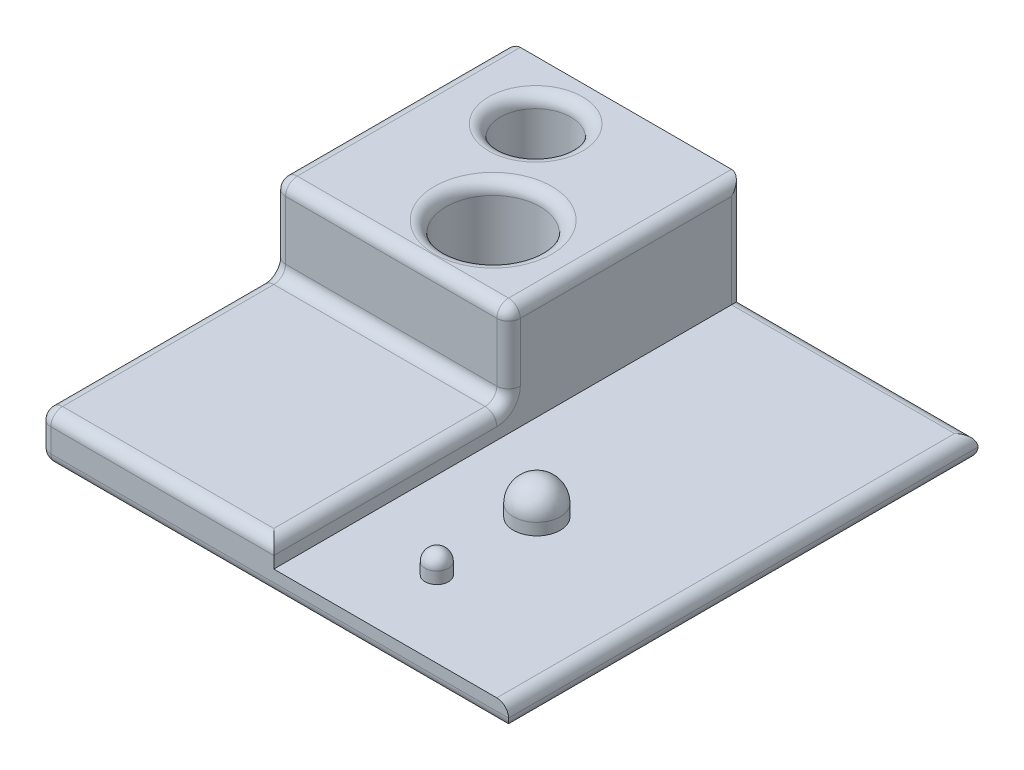
ISO-10303-21;
HEADER;
FILE_DESCRIPTION(('STEP AP214'),'2;1');
FILE_NAME('part.step','',(''),(''),'','','');
FILE_SCHEMA(('AUTOMOTIVE_DESIGN { 1 0 10303 214 1 1 1 1 }'));
ENDSEC;
DATA;
#1=APPLICATION_CONTEXT('core data for automotive mechanical design processes');
#2=APPLICATION_PROTOCOL_DEFINITION('international standard','automotive_design',2000,#1);
#3=PRODUCT_CONTEXT('',#1,'mechanical');
#4=PRODUCT('Part','Part','',(#3));
#5=PRODUCT_RELATED_PRODUCT_CATEGORY('part','',(#4));
#6=PRODUCT_DEFINITION_FORMATION('','',#4);
#7=PRODUCT_DEFINITION_CONTEXT('part definition',#1,'design');
#8=PRODUCT_DEFINITION('design','',#6,#7);
#9=PRODUCT_DEFINITION_SHAPE('','',#8);
#10=(LENGTH_UNIT() NAMED_UNIT(*) SI_UNIT(.MILLI.,.METRE.));
#11=(NAMED_UNIT(*) PLANE_ANGLE_UNIT() SI_UNIT($,.RADIAN.));
#12=(NAMED_UNIT(*) SI_UNIT($,.STERADIAN.) SOLID_ANGLE_UNIT());
#13=UNCERTAINTY_MEASURE_WITH_UNIT(LENGTH_MEASURE(1.E-05),#10,'distance_accuracy_value','');
#14=(GEOMETRIC_REPRESENTATION_CONTEXT(3) GLOBAL_UNCERTAINTY_ASSIGNED_CONTEXT((#13)) GLOBAL_UNIT_ASSIGNED_CONTEXT((#10,
#11,#12)) REPRESENTATION_CONTEXT('',''));
#15=CARTESIAN_POINT('',(0.,0.,0.));
#16=DIRECTION('',(0.,0.,1.));
#17=DIRECTION('',(1.,0.,0.));
#18=AXIS2_PLACEMENT_3D('',#15,#16,#17);
#19=CARTESIAN_POINT('',(0.,2.,0.));
#20=DIRECTION('',(0.,-1.,0.));
#21=DIRECTION('',(0.,0.,-1.));
#22=AXIS2_PLACEMENT_3D('',#19,#20,#21);
#23=PLANE('',#22);
#24=DIRECTION('',(1.,0.,0.));
#25=VECTOR('',#24,1.);
#26=CARTESIAN_POINT('',(0.,2.,-9.5));
#27=LINE('',#26,#25);
#28=CARTESIAN_POINT('',(9.5,2.,-9.5));
#29=VERTEX_POINT('',#28);
#30=CARTESIAN_POINT('',(0.5,2.,-9.5));
#31=VERTEX_POINT('',#30);
#32=EDGE_CURVE('E280',#29,#31,#27,.F.);
#33=ORIENTED_EDGE('',*,*,#32,.T.);
#34=DIRECTION('',(0.,0.,1.));
#35=VECTOR('',#34,1.);
#36=CARTESIAN_POINT('',(0.5,2.,0.));
#37=LINE('',#36,#35);
#38=CARTESIAN_POINT('',(0.5,2.,-0.5));
#39=VERTEX_POINT('',#38);
#40=EDGE_CURVE('E286',#31,#39,#37,.T.);
#41=ORIENTED_EDGE('',*,*,#40,.T.);
#42=DIRECTION('',(1.,0.,0.));
#43=VECTOR('',#42,1.);
#44=CARTESIAN_POINT('',(0.,2.,-0.5));
#45=LINE('',#44,#43);
#46=CARTESIAN_POINT('',(9.5,2.,-0.5));
#47=VERTEX_POINT('',#46);
#48=EDGE_CURVE('E283',#39,#47,#45,.T.);
#49=ORIENTED_EDGE('',*,*,#48,.T.);
#50=DIRECTION('',(0.,0.,-1.));
#51=VECTOR('',#50,1.);
#52=CARTESIAN_POINT('',(9.5,2.,0.));
#53=LINE('',#52,#51);
#54=EDGE_CURVE('E277',#47,#29,#53,.T.);
#55=ORIENTED_EDGE('',*,*,#54,.T.);
#56=EDGE_LOOP('',(#33,#41,#49,#55));
#57=FACE_BOUND('',#56,.T.);
#58=ADVANCED_FACE('F44',(#57),#23,.F.);
#59=CARTESIAN_POINT('',(10.,2.,0.));
#60=DIRECTION('',(-1.,0.,0.));
#61=DIRECTION('',(0.,0.,1.));
#62=AXIS2_PLACEMENT_3D('',#59,#60,#61);
#63=PLANE('',#62);
#64=CARTESIAN_POINT('',(10.,2.5,-9.5));
#65=DIRECTION('',(-1.,0.,0.));
#66=DIRECTION('',(0.,0.,1.));
#67=AXIS2_PLACEMENT_3D('',#64,#65,#66);
#68=CIRCLE('',#67,1.);
#69=CARTESIAN_POINT('',(10.,1.5,-9.5));
#70=VERTEX_POINT('',#69);
#71=CARTESIAN_POINT('',(10.,2.5,-10.5));
#72=VERTEX_POINT('',#71);
#73=EDGE_CURVE('E361',#70,#72,#68,.F.);
#74=ORIENTED_EDGE('',*,*,#73,.F.);
#75=DIRECTION('',(0.,0.,-1.));
#76=VECTOR('',#75,1.);
#77=CARTESIAN_POINT('',(10.,1.5,0.));
#78=LINE('',#77,#76);
#79=CARTESIAN_POINT('',(10.,1.5,0.));
#80=VERTEX_POINT('',#79);
#81=EDGE_CURVE('E374',#70,#80,#78,.F.);
#82=ORIENTED_EDGE('',*,*,#81,.T.);
#83=DIRECTION('',(0.,-1.,0.));
#84=VECTOR('',#83,1.);
#85=CARTESIAN_POINT('',(10.,2.,0.));
#86=LINE('',#85,#84);
#87=CARTESIAN_POINT('',(10.,1.,0.));
#88=VERTEX_POINT('',#87);
#89=EDGE_CURVE('E173',#80,#88,#86,.T.);
#90=ORIENTED_EDGE('',*,*,#89,.T.);
#91=DIRECTION('',(0.,0.,1.));
#92=VECTOR('',#91,1.);
#93=CARTESIAN_POINT('',(10.,1.,0.));
#94=LINE('',#93,#92);
#95=CARTESIAN_POINT('',(10.,1.,-19.5));
#96=VERTEX_POINT('',#95);
#97=EDGE_CURVE('E252',#96,#88,#94,.T.);
#98=ORIENTED_EDGE('',*,*,#97,.F.);
#99=DIRECTION('',(0.,-1.,0.));
#100=VECTOR('',#99,1.);
#101=CARTESIAN_POINT('',(10.,2.,-19.5));
#102=LINE('',#101,#100);
#103=CARTESIAN_POINT('',(10.,5.,-19.5));
#104=VERTEX_POINT('',#103);
#105=EDGE_CURVE('E371',#96,#104,#102,.F.);
#106=ORIENTED_EDGE('',*,*,#105,.T.);
#107=DIRECTION('',(0.,0.,-1.));
#108=VECTOR('',#107,1.);
#109=CARTESIAN_POINT('',(10.,5.,-10.));
#110=LINE('',#109,#108);
#111=CARTESIAN_POINT('',(10.,5.,-10.5));
#112=VERTEX_POINT('',#111);
#113=EDGE_CURVE('E368',#104,#112,#110,.F.);
#114=ORIENTED_EDGE('',*,*,#113,.T.);
#115=DIRECTION('',(0.,-1.,0.));
#116=VECTOR('',#115,1.);
#117=CARTESIAN_POINT('',(10.,2.,-10.5));
#118=LINE('',#117,#116);
#119=EDGE_CURVE('E365',#112,#72,#118,.T.);
#120=ORIENTED_EDGE('',*,*,#119,.T.);
#121=EDGE_LOOP('',(#74,#82,#90,#98,#106,#114,#120));
#122=FACE_BOUND('',#121,.T.);
#123=ADVANCED_FACE('F494',(#122),#63,.F.);
#124=CARTESIAN_POINT('',(0.,2.,0.));
#125=DIRECTION('',(1.,0.,0.));
#126=DIRECTION('',(0.,0.,-1.));
#127=AXIS2_PLACEMENT_3D('',#124,#125,#126);
#128=PLANE('',#127);
#129=DIRECTION('',(0.,0.,1.));
#130=VECTOR('',#129,1.);
#131=CARTESIAN_POINT('',(0.,0.5,0.));
#132=LINE('',#131,#130);
#133=CARTESIAN_POINT('',(0.,0.5,-19.5));
#134=VERTEX_POINT('',#133);
#135=CARTESIAN_POINT('',(0.,0.5,-0.5));
#136=VERTEX_POINT('',#135);
#137=EDGE_CURVE('E299',#134,#136,#132,.T.);
#138=ORIENTED_EDGE('',*,*,#137,.T.);
#139=DIRECTION('',(0.,-1.,0.));
#140=VECTOR('',#139,1.);
#141=CARTESIAN_POINT('',(0.,2.,-0.5));
#142=LINE('',#141,#140);
#143=CARTESIAN_POINT('',(0.,1.5,-0.5));
#144=VERTEX_POINT('',#143);
#145=EDGE_CURVE('E310',#136,#144,#142,.F.);
#146=ORIENTED_EDGE('',*,*,#145,.T.);
#147=DIRECTION('',(0.,0.,1.));
#148=VECTOR('',#147,1.);
#149=CARTESIAN_POINT('',(0.,1.5,0.));
#150=LINE('',#149,#148);
#151=CARTESIAN_POINT('',(0.,1.5,-9.5));
#152=VERTEX_POINT('',#151);
#153=EDGE_CURVE('E306',#144,#152,#150,.F.);
#154=ORIENTED_EDGE('',*,*,#153,.T.);
#155=CARTESIAN_POINT('',(0.,2.5,-9.5));
#156=DIRECTION('',(1.,0.,0.));
#157=DIRECTION('',(0.,0.,-1.));
#158=AXIS2_PLACEMENT_3D('',#155,#156,#157);
#159=CIRCLE('',#158,1.);
#160=CARTESIAN_POINT('',(0.,2.5,-10.5));
#161=VERTEX_POINT('',#160);
#162=EDGE_CURVE('E302',#161,#152,#159,.F.);
#163=ORIENTED_EDGE('',*,*,#162,.F.);
#164=DIRECTION('',(0.,-1.,0.));
#165=VECTOR('',#164,1.);
#166=CARTESIAN_POINT('',(0.,2.,-10.5));
#167=LINE('',#166,#165);
#168=CARTESIAN_POINT('',(0.,5.,-10.5));
#169=VERTEX_POINT('',#168);
#170=EDGE_CURVE('E293',#161,#169,#167,.F.);
#171=ORIENTED_EDGE('',*,*,#170,.T.);
#172=DIRECTION('',(0.,0.,1.));
#173=VECTOR('',#172,1.);
#174=CARTESIAN_POINT('',(0.,5.,-20.));
#175=LINE('',#174,#173);
#176=CARTESIAN_POINT('',(0.,5.,-19.5));
#177=VERTEX_POINT('',#176);
#178=EDGE_CURVE('E290',#169,#177,#175,.F.);
#179=ORIENTED_EDGE('',*,*,#178,.T.);
#180=DIRECTION('',(0.,-1.,0.));
#181=VECTOR('',#180,1.);
#182=CARTESIAN_POINT('',(0.,2.,-19.5));
#183=LINE('',#182,#181);
#184=EDGE_CURVE('E296',#177,#134,#183,.T.);
#185=ORIENTED_EDGE('',*,*,#184,.T.);
#186=EDGE_LOOP('',(#138,#146,#154,#163,#171,#179,#185));
#187=FACE_BOUND('',#186,.T.);
#188=ADVANCED_FACE('F518',(#187),#128,.F.);
#189=CARTESIAN_POINT('',(0.,2.,0.));
#190=DIRECTION('',(0.,0.,-1.));
#191=DIRECTION('',(-1.,0.,0.));
#192=AXIS2_PLACEMENT_3D('',#189,#190,#191);
#193=PLANE('',#192);
#194=DIRECTION('',(1.,0.,0.));
#195=VECTOR('',#194,1.);
#196=CARTESIAN_POINT('',(20.,0.5,0.));
#197=LINE('',#196,#195);
#198=CARTESIAN_POINT('',(0.5,0.5,0.));
#199=VERTEX_POINT('',#198);
#200=CARTESIAN_POINT('',(20.,0.5,0.));
#201=VERTEX_POINT('',#200);
#202=EDGE_CURVE('E335',#199,#201,#197,.T.);
#203=ORIENTED_EDGE('',*,*,#202,.T.);
#204=CARTESIAN_POINT('',(19.5,0.5,0.));
#205=DIRECTION('',(0.,0.,-1.));
#206=DIRECTION('',(-1.,0.,0.));
#207=AXIS2_PLACEMENT_3D('',#204,#205,#206);
#208=CIRCLE('',#207,0.5);
#209=CARTESIAN_POINT('',(19.5,1.,0.));
#210=VERTEX_POINT('',#209);
#211=EDGE_CURVE('E210',#201,#210,#208,.F.);
#212=ORIENTED_EDGE('',*,*,#211,.T.);
#213=DIRECTION('',(1.,0.,0.));
#214=VECTOR('',#213,1.);
#215=CARTESIAN_POINT('',(10.,1.,0.));
#216=LINE('',#215,#214);
#217=EDGE_CURVE('E255',#88,#210,#216,.T.);
#218=ORIENTED_EDGE('',*,*,#217,.F.);
#219=ORIENTED_EDGE('',*,*,#89,.F.);
#220=DIRECTION('',(1.,0.,0.));
#221=VECTOR('',#220,1.);
#222=CARTESIAN_POINT('',(0.,1.5,0.));
#223=LINE('',#222,#221);
#224=CARTESIAN_POINT('',(0.5,1.5,0.));
#225=VERTEX_POINT('',#224);
#226=EDGE_CURVE('E329',#80,#225,#223,.F.);
#227=ORIENTED_EDGE('',*,*,#226,.T.);
#228=DIRECTION('',(0.,-1.,0.));
#229=VECTOR('',#228,1.);
#230=CARTESIAN_POINT('',(0.5,2.,0.));
#231=LINE('',#230,#229);
#232=EDGE_CURVE('E332',#225,#199,#231,.T.);
#233=ORIENTED_EDGE('',*,*,#232,.T.);
#234=EDGE_LOOP('',(#203,#212,#218,#219,#227,#233));
#235=FACE_BOUND('',#234,.T.);
#236=ADVANCED_FACE('F500',(#235),#193,.F.);
#237=CARTESIAN_POINT('',(0.,2.,-20.));
#238=DIRECTION('',(0.,0.,1.));
#239=DIRECTION('',(1.,0.,0.));
#240=AXIS2_PLACEMENT_3D('',#237,#238,#239);
#241=PLANE('',#240);
#242=DIRECTION('',(-1.,0.,0.));
#243=VECTOR('',#242,1.);
#244=CARTESIAN_POINT('',(0.,0.5,-20.));
#245=LINE('',#244,#243);
#246=CARTESIAN_POINT('',(9.5,0.5,-20.));
#247=VERTEX_POINT('',#246);
#248=CARTESIAN_POINT('',(0.5,0.5,-20.));
#249=VERTEX_POINT('',#248);
#250=EDGE_CURVE('E202',#247,#249,#245,.T.);
#251=ORIENTED_EDGE('',*,*,#250,.T.);
#252=DIRECTION('',(0.,-1.,0.));
#253=VECTOR('',#252,1.);
#254=CARTESIAN_POINT('',(0.5,2.,-20.));
#255=LINE('',#254,#253);
#256=CARTESIAN_POINT('',(0.5,5.5,-20.));
#257=VERTEX_POINT('',#256);
#258=EDGE_CURVE('E345',#249,#257,#255,.F.);
#259=ORIENTED_EDGE('',*,*,#258,.T.);
#260=DIRECTION('',(-1.,0.,0.));
#261=VECTOR('',#260,1.);
#262=CARTESIAN_POINT('',(0.,5.5,-20.));
#263=LINE('',#262,#261);
#264=CARTESIAN_POINT('',(9.5,5.5,-20.));
#265=VERTEX_POINT('',#264);
#266=EDGE_CURVE('E246',#265,#257,#263,.T.);
#267=ORIENTED_EDGE('',*,*,#266,.F.);
#268=DIRECTION('',(0.,-1.,0.));
#269=VECTOR('',#268,1.);
#270=CARTESIAN_POINT('',(9.5,2.,-20.));
#271=LINE('',#270,#269);
#272=EDGE_CURVE('E340',#265,#247,#271,.T.);
#273=ORIENTED_EDGE('',*,*,#272,.T.);
#274=EDGE_LOOP('',(#251,#259,#267,#273));
#275=FACE_BOUND('',#274,.T.);
#276=ADVANCED_FACE('F489',(#275),#241,.F.);
#277=CARTESIAN_POINT('',(0.,0.,0.));
#278=DIRECTION('',(0.,-1.,0.));
#279=DIRECTION('',(0.,0.,-1.));
#280=AXIS2_PLACEMENT_3D('',#277,#278,#279);
#281=PLANE('',#280);
#282=DIRECTION('',(-1.,0.,0.));
#283=VECTOR('',#282,1.);
#284=CARTESIAN_POINT('',(20.,0.,-19.5));
#285=LINE('',#284,#283);
#286=CARTESIAN_POINT('',(0.5,0.,-19.5));
#287=VERTEX_POINT('',#286);
#288=CARTESIAN_POINT('',(19.5,0.,-19.5));
#289=VERTEX_POINT('',#288);
#290=EDGE_CURVE('E319',#287,#289,#285,.F.);
#291=ORIENTED_EDGE('',*,*,#290,.T.);
#292=DIRECTION('',(0.,0.,-1.));
#293=VECTOR('',#292,1.);
#294=CARTESIAN_POINT('',(19.5,0.,0.));
#295=LINE('',#294,#293);
#296=CARTESIAN_POINT('',(19.5,0.,-0.5));
#297=VERTEX_POINT('',#296);
#298=EDGE_CURVE('E218',#289,#297,#295,.F.);
#299=ORIENTED_EDGE('',*,*,#298,.T.);
#300=DIRECTION('',(1.,0.,0.));
#301=VECTOR('',#300,1.);
#302=CARTESIAN_POINT('',(0.,0.,-0.5));
#303=LINE('',#302,#301);
#304=CARTESIAN_POINT('',(0.5,0.,-0.5));
#305=VERTEX_POINT('',#304);
#306=EDGE_CURVE('E313',#297,#305,#303,.F.);
#307=ORIENTED_EDGE('',*,*,#306,.T.);
#308=DIRECTION('',(0.,0.,1.));
#309=VECTOR('',#308,1.);
#310=CARTESIAN_POINT('',(0.5,0.,-20.));
#311=LINE('',#310,#309);
#312=EDGE_CURVE('E316',#305,#287,#311,.F.);
#313=ORIENTED_EDGE('',*,*,#312,.T.);
#314=EDGE_LOOP('',(#291,#299,#307,#313));
#315=FACE_BOUND('',#314,.T.);
#316=ADVANCED_FACE('F523',(#315),#281,.T.);
#317=CARTESIAN_POINT('',(0.,1.,0.));
#318=DIRECTION('',(0.,-1.,0.));
#319=DIRECTION('',(0.,0.,-1.));
#320=AXIS2_PLACEMENT_3D('',#317,#318,#319);
#321=PLANE('',#320);
#322=CARTESIAN_POINT('',(13.6729590686425,1.,-7.53387033962573));
#323=DIRECTION('',(0.,-1.,0.));
#324=DIRECTION('',(0.,0.,-1.));
#325=AXIS2_PLACEMENT_3D('',#322,#323,#324);
#326=CIRCLE('',#325,1.);
#327=CARTESIAN_POINT('',(13.6729590686425,1.,-8.53387033962573));
#328=VERTEX_POINT('',#327);
#329=EDGE_CURVE('E269',#328,#328,#326,.F.);
#330=ORIENTED_EDGE('',*,*,#329,.F.);
#331=EDGE_LOOP('',(#330));
#332=FACE_BOUND('',#331,.T.);
#333=CARTESIAN_POINT('',(13.6915029025337,1.,-3.25274872455439));
#334=DIRECTION('',(0.,-1.,0.));
#335=DIRECTION('',(0.,0.,-1.));
#336=AXIS2_PLACEMENT_3D('',#333,#334,#335);
#337=CIRCLE('',#336,0.500000000000001);
#338=CARTESIAN_POINT('',(13.6915029025337,1.,-3.75274872455439));
#339=VERTEX_POINT('',#338);
#340=EDGE_CURVE('E261',#339,#339,#337,.F.);
#341=ORIENTED_EDGE('',*,*,#340,.F.);
#342=EDGE_LOOP('',(#341));
#343=FACE_BOUND('',#342,.T.);
#344=ORIENTED_EDGE('',*,*,#217,.T.);
#345=DIRECTION('',(0.,0.,-1.));
#346=VECTOR('',#345,1.);
#347=CARTESIAN_POINT('',(19.5,1.,0.));
#348=LINE('',#347,#346);
#349=CARTESIAN_POINT('',(19.5,1.,-19.5));
#350=VERTEX_POINT('',#349);
#351=EDGE_CURVE('E326',#210,#350,#348,.T.);
#352=ORIENTED_EDGE('',*,*,#351,.T.);
#353=DIRECTION('',(-1.,0.,0.));
#354=VECTOR('',#353,1.);
#355=CARTESIAN_POINT('',(0.,1.,-19.5));
#356=LINE('',#355,#354);
#357=EDGE_CURVE('E185',#350,#96,#356,.T.);
#358=ORIENTED_EDGE('',*,*,#357,.T.);
#359=ORIENTED_EDGE('',*,*,#97,.T.);
#360=EDGE_LOOP('',(#344,#352,#358,#359));
#361=FACE_BOUND('',#360,.T.);
#362=ADVANCED_FACE('F498',(#332,#343,#361),#321,.F.);
#363=CARTESIAN_POINT('',(13.6915029025337,2.,-3.25274872455439));
#364=DIRECTION('',(0.,-1.,0.));
#365=DIRECTION('',(0.,0.,-1.));
#366=AXIS2_PLACEMENT_3D('',#363,#364,#365);
#367=CYLINDRICAL_SURFACE('',#366,0.500000000000001);
#368=CARTESIAN_POINT('',(13.6915029025337,1.5,-3.25274872455439));
#369=DIRECTION('',(0.,-1.,0.));
#370=DIRECTION('',(0.,0.,-1.));
#371=AXIS2_PLACEMENT_3D('',#368,#369,#370);
#372=CIRCLE('',#371,0.500000000000001);
#373=CARTESIAN_POINT('',(13.6915029025337,1.5,-3.75274872455439));
#374=VERTEX_POINT('',#373);
#375=EDGE_CURVE('E265',#374,#374,#372,.T.);
#376=ORIENTED_EDGE('',*,*,#375,.T.);
#377=EDGE_LOOP('',(#376));
#378=FACE_BOUND('',#377,.T.);
#379=ORIENTED_EDGE('',*,*,#340,.T.);
#380=EDGE_LOOP('',(#379));
#381=FACE_BOUND('',#380,.T.);
#382=ADVANCED_FACE('F530',(#378,#381),#367,.T.);
#383=CARTESIAN_POINT('',(13.6915029025337,1.5,-3.25274872455439));
#384=DIRECTION('',(0.,1.,0.));
#385=DIRECTION('',(0.,0.,1.));
#386=AXIS2_PLACEMENT_3D('',#383,#384,#385);
#387=SPHERICAL_SURFACE('',#386,0.5);
#388=ORIENTED_EDGE('',*,*,#375,.F.);
#389=EDGE_LOOP('',(#388));
#390=FACE_BOUND('',#389,.T.);
#391=ADVANCED_FACE('F545',(#390),#387,.T.);
#392=CARTESIAN_POINT('',(13.6729590686425,2.5,-7.53387033962573));
#393=DIRECTION('',(0.,-1.,0.));
#394=DIRECTION('',(0.,0.,-1.));
#395=AXIS2_PLACEMENT_3D('',#392,#393,#394);
#396=CYLINDRICAL_SURFACE('',#395,1.);
#397=CARTESIAN_POINT('',(13.6729590686425,1.5,-7.53387033962573));
#398=DIRECTION('',(0.,-1.,0.));
#399=DIRECTION('',(0.,0.,-1.));
#400=AXIS2_PLACEMENT_3D('',#397,#398,#399);
#401=CIRCLE('',#400,1.);
#402=CARTESIAN_POINT('',(13.6729590686425,1.5,-8.53387033962573));
#403=VERTEX_POINT('',#402);
#404=EDGE_CURVE('E273',#403,#403,#401,.T.);
#405=ORIENTED_EDGE('',*,*,#404,.T.);
#406=EDGE_LOOP('',(#405));
#407=FACE_BOUND('',#406,.T.);
#408=ORIENTED_EDGE('',*,*,#329,.T.);
#409=EDGE_LOOP('',(#408));
#410=FACE_BOUND('',#409,.T.);
#411=ADVANCED_FACE('F547',(#407,#410),#396,.T.);
#412=CARTESIAN_POINT('',(13.6729590686425,1.5,-7.53387033962573));
#413=DIRECTION('',(0.,1.,0.));
#414=DIRECTION('',(0.,0.,1.));
#415=AXIS2_PLACEMENT_3D('',#412,#413,#414);
#416=SPHERICAL_SURFACE('',#415,1.);
#417=ORIENTED_EDGE('',*,*,#404,.F.);
#418=EDGE_LOOP('',(#417));
#419=FACE_BOUND('',#418,.T.);
#420=ADVANCED_FACE('F550',(#419),#416,.T.);
#421=CARTESIAN_POINT('',(0.,5.5,-10.));
#422=DIRECTION('',(0.,0.,-1.));
#423=DIRECTION('',(-1.,0.,0.));
#424=AXIS2_PLACEMENT_3D('',#421,#422,#423);
#425=PLANE('',#424);
#426=DIRECTION('',(0.,-1.,0.));
#427=VECTOR('',#426,1.);
#428=CARTESIAN_POINT('',(0.5,5.5,-10.));
#429=LINE('',#428,#427);
#430=CARTESIAN_POINT('',(0.5,5.,-10.));
#431=VERTEX_POINT('',#430);
#432=CARTESIAN_POINT('',(0.5,2.5,-10.));
#433=VERTEX_POINT('',#432);
#434=EDGE_CURVE('E351',#431,#433,#429,.T.);
#435=ORIENTED_EDGE('',*,*,#434,.T.);
#436=DIRECTION('',(1.,0.,0.));
#437=VECTOR('',#436,1.);
#438=CARTESIAN_POINT('',(10.,2.5,-10.));
#439=LINE('',#438,#437);
#440=CARTESIAN_POINT('',(9.5,2.5,-10.));
#441=VERTEX_POINT('',#440);
#442=EDGE_CURVE('E357',#433,#441,#439,.T.);
#443=ORIENTED_EDGE('',*,*,#442,.T.);
#444=DIRECTION('',(0.,-1.,0.));
#445=VECTOR('',#444,1.);
#446=CARTESIAN_POINT('',(9.5,5.5,-10.));
#447=LINE('',#446,#445);
#448=CARTESIAN_POINT('',(9.5,5.,-10.));
#449=VERTEX_POINT('',#448);
#450=EDGE_CURVE('E354',#441,#449,#447,.F.);
#451=ORIENTED_EDGE('',*,*,#450,.T.);
#452=DIRECTION('',(1.,0.,0.));
#453=VECTOR('',#452,1.);
#454=CARTESIAN_POINT('',(0.,5.,-10.));
#455=LINE('',#454,#453);
#456=EDGE_CURVE('E348',#449,#431,#455,.F.);
#457=ORIENTED_EDGE('',*,*,#456,.T.);
#458=EDGE_LOOP('',(#435,#443,#451,#457));
#459=FACE_BOUND('',#458,.T.);
#460=ADVANCED_FACE('F552',(#459),#425,.F.);
#461=CARTESIAN_POINT('',(0.,5.5,0.));
#462=DIRECTION('',(0.,1.,0.));
#463=DIRECTION('',(0.,0.,1.));
#464=AXIS2_PLACEMENT_3D('',#461,#462,#463);
#465=PLANE('',#464);
#466=CARTESIAN_POINT('',(6.3008055094386,5.5,-13.0433089425895));
#467=DIRECTION('',(0.,1.,0.));
#468=DIRECTION('',(0.,0.,1.));
#469=AXIS2_PLACEMENT_3D('',#466,#467,#468);
#470=CIRCLE('',#469,2.5);
#471=CARTESIAN_POINT('',(6.3008055094386,5.5,-10.5433089425895));
#472=VERTEX_POINT('',#471);
#473=EDGE_CURVE('E381',#472,#472,#470,.F.);
#474=ORIENTED_EDGE('',*,*,#473,.T.);
#475=EDGE_LOOP('',(#474));
#476=FACE_BOUND('',#475,.T.);
#477=CARTESIAN_POINT('',(3.65102789563221,5.5,-17.5033306687983));
#478=DIRECTION('',(0.,1.,0.));
#479=DIRECTION('',(0.,0.,1.));
#480=AXIS2_PLACEMENT_3D('',#477,#478,#479);
#481=CIRCLE('',#480,2.);
#482=CARTESIAN_POINT('',(3.65102789563221,5.5,-15.5033306687983));
#483=VERTEX_POINT('',#482);
#484=EDGE_CURVE('E377',#483,#483,#481,.F.);
#485=ORIENTED_EDGE('',*,*,#484,.T.);
#486=EDGE_LOOP('',(#485));
#487=FACE_BOUND('',#486,.T.);
#488=DIRECTION('',(1.,0.,0.));
#489=VECTOR('',#488,1.);
#490=CARTESIAN_POINT('',(10.,5.5,-10.5));
#491=LINE('',#490,#489);
#492=CARTESIAN_POINT('',(0.5,5.5,-10.5));
#493=VERTEX_POINT('',#492);
#494=CARTESIAN_POINT('',(9.5,5.5,-10.5));
#495=VERTEX_POINT('',#494);
#496=EDGE_CURVE('E63',#493,#495,#491,.T.);
#497=ORIENTED_EDGE('',*,*,#496,.T.);
#498=DIRECTION('',(0.,0.,-1.));
#499=VECTOR('',#498,1.);
#500=CARTESIAN_POINT('',(9.5,5.5,-20.));
#501=LINE('',#500,#499);
#502=EDGE_CURVE('E390',#495,#265,#501,.T.);
#503=ORIENTED_EDGE('',*,*,#502,.T.);
#504=ORIENTED_EDGE('',*,*,#266,.T.);
#505=DIRECTION('',(0.,0.,1.));
#506=VECTOR('',#505,1.);
#507=CARTESIAN_POINT('',(0.5,5.5,-10.));
#508=LINE('',#507,#506);
#509=EDGE_CURVE('E387',#257,#493,#508,.T.);
#510=ORIENTED_EDGE('',*,*,#509,.T.);
#511=EDGE_LOOP('',(#497,#503,#504,#510));
#512=FACE_BOUND('',#511,.T.);
#513=ADVANCED_FACE('F555',(#476,#487,#512),#465,.T.);
#514=CARTESIAN_POINT('',(3.65102789563221,1.5,-17.5033306687983));
#515=DIRECTION('',(0.,1.,0.));
#516=DIRECTION('',(0.,0.,1.));
#517=AXIS2_PLACEMENT_3D('',#514,#515,#516);
#518=CYLINDRICAL_SURFACE('',#517,1.5);
#519=CARTESIAN_POINT('',(3.65102789563221,5.,-17.5033306687983));
#520=DIRECTION('',(0.,1.,0.));
#521=DIRECTION('',(0.,0.,1.));
#522=AXIS2_PLACEMENT_3D('',#519,#520,#521);
#523=CIRCLE('',#522,1.5);
#524=CARTESIAN_POINT('',(3.65102789563221,5.,-16.0033306687983));
#525=VERTEX_POINT('',#524);
#526=EDGE_CURVE('E11',#525,#525,#523,.T.);
#527=ORIENTED_EDGE('',*,*,#526,.T.);
#528=EDGE_LOOP('',(#527));
#529=FACE_BOUND('',#528,.T.);
#530=CARTESIAN_POINT('',(3.65102789563221,1.5,-17.5033306687983));
#531=DIRECTION('',(0.,1.,0.));
#532=DIRECTION('',(0.,0.,1.));
#533=AXIS2_PLACEMENT_3D('',#530,#531,#532);
#534=CIRCLE('',#533,1.5);
#535=CARTESIAN_POINT('',(3.65102789563221,1.5,-16.0033306687983));
#536=VERTEX_POINT('',#535);
#537=EDGE_CURVE('E240',#536,#536,#534,.T.);
#538=ORIENTED_EDGE('',*,*,#537,.F.);
#539=EDGE_LOOP('',(#538));
#540=FACE_BOUND('',#539,.T.);
#541=ADVANCED_FACE('F559',(#529,#540),#518,.F.);
#542=CARTESIAN_POINT('',(3.65102789563221,1.5,-17.5033306687983));
#543=DIRECTION('',(0.,1.,0.));
#544=DIRECTION('',(0.,0.,1.));
#545=AXIS2_PLACEMENT_3D('',#542,#543,#544);
#546=PLANE('',#545);
#547=ORIENTED_EDGE('',*,*,#537,.T.);
#548=EDGE_LOOP('',(#547));
#549=FACE_BOUND('',#548,.T.);
#550=ADVANCED_FACE('F563',(#549),#546,.T.);
#551=CARTESIAN_POINT('',(6.3008055094386,0.5,-13.0433089425895));
#552=DIRECTION('',(0.,1.,0.));
#553=DIRECTION('',(0.,0.,1.));
#554=AXIS2_PLACEMENT_3D('',#551,#552,#553);
#555=CYLINDRICAL_SURFACE('',#554,2.);
#556=CARTESIAN_POINT('',(6.3008055094386,5.,-13.0433089425895));
#557=DIRECTION('',(0.,1.,0.));
#558=DIRECTION('',(0.,0.,1.));
#559=AXIS2_PLACEMENT_3D('',#556,#557,#558);
#560=CIRCLE('',#559,2.);
#561=CARTESIAN_POINT('',(6.3008055094386,5.,-11.0433089425895));
#562=VERTEX_POINT('',#561);
#563=EDGE_CURVE('E55',#562,#562,#560,.T.);
#564=ORIENTED_EDGE('',*,*,#563,.T.);
#565=EDGE_LOOP('',(#564));
#566=FACE_BOUND('',#565,.T.);
#567=CARTESIAN_POINT('',(6.3008055094386,0.5,-13.0433089425895));
#568=DIRECTION('',(0.,1.,0.));
#569=DIRECTION('',(0.,0.,1.));
#570=AXIS2_PLACEMENT_3D('',#567,#568,#569);
#571=CIRCLE('',#570,2.);
#572=CARTESIAN_POINT('',(6.3008055094386,0.5,-11.0433089425895));
#573=VERTEX_POINT('',#572);
#574=EDGE_CURVE('E236',#573,#573,#571,.T.);
#575=ORIENTED_EDGE('',*,*,#574,.F.);
#576=EDGE_LOOP('',(#575));
#577=FACE_BOUND('',#576,.T.);
#578=ADVANCED_FACE('F567',(#566,#577),#555,.F.);
#579=CARTESIAN_POINT('',(6.3008055094386,0.5,-13.0433089425895));
#580=DIRECTION('',(0.,1.,0.));
#581=DIRECTION('',(0.,0.,1.));
#582=AXIS2_PLACEMENT_3D('',#579,#580,#581);
#583=PLANE('',#582);
#584=ORIENTED_EDGE('',*,*,#574,.T.);
#585=EDGE_LOOP('',(#584));
#586=FACE_BOUND('',#585,.T.);
#587=ADVANCED_FACE('F571',(#586),#583,.T.);
#588=CARTESIAN_POINT('',(9.5,2.,-19.5));
#589=DIRECTION('',(0.,-1.,0.));
#590=DIRECTION('',(0.,0.,-1.));
#591=AXIS2_PLACEMENT_3D('',#588,#589,#590);
#592=CYLINDRICAL_SURFACE('',#591,0.5);
#593=CARTESIAN_POINT('',(9.5,5.,-19.5));
#594=DIRECTION('',(0.,0.707106781186547,0.707106781186547));
#595=DIRECTION('',(0.,-0.707106781186547,0.707106781186547));
#596=AXIS2_PLACEMENT_3D('',#593,#594,#595);
#597=ELLIPSE('',#596,0.707106781186547,0.5);
#598=EDGE_CURVE('E191',#104,#265,#597,.T.);
#599=ORIENTED_EDGE('',*,*,#598,.F.);
#600=ORIENTED_EDGE('',*,*,#105,.F.);
#601=CARTESIAN_POINT('',(9.5,0.5,-19.5));
#602=DIRECTION('',(-0.707106781186547,0.707106781186547,0.));
#603=DIRECTION('',(-0.707106781186547,-0.707106781186547,0.));
#604=AXIS2_PLACEMENT_3D('',#601,#602,#603);
#605=ELLIPSE('',#604,0.707106781186547,0.5);
#606=EDGE_CURVE('E48',#247,#96,#605,.F.);
#607=ORIENTED_EDGE('',*,*,#606,.F.);
#608=ORIENTED_EDGE('',*,*,#272,.F.);
#609=EDGE_LOOP('',(#599,#600,#607,#608));
#610=FACE_BOUND('',#609,.T.);
#611=ADVANCED_FACE('F493',(#610),#592,.T.);
#612=CARTESIAN_POINT('',(0.,0.5,-19.5));
#613=DIRECTION('',(-1.,0.,0.));
#614=DIRECTION('',(0.,0.,1.));
#615=AXIS2_PLACEMENT_3D('',#612,#613,#614);
#616=CYLINDRICAL_SURFACE('',#615,0.5);
#617=ORIENTED_EDGE('',*,*,#606,.T.);
#618=ORIENTED_EDGE('',*,*,#357,.F.);
#619=CARTESIAN_POINT('',(19.5,0.5,-19.5));
#620=DIRECTION('',(-0.707106781186547,0.,-0.707106781186547));
#621=DIRECTION('',(-0.707106781186547,0.,0.707106781186547));
#622=AXIS2_PLACEMENT_3D('',#619,#620,#621);
#623=ELLIPSE('',#622,0.707106781186547,0.5);
#624=CARTESIAN_POINT('',(20.,0.5,-20.));
#625=VERTEX_POINT('',#624);
#626=EDGE_CURVE('E179',#625,#350,#623,.F.);
#627=ORIENTED_EDGE('',*,*,#626,.F.);
#628=DIRECTION('',(-1.,0.,0.));
#629=VECTOR('',#628,1.);
#630=CARTESIAN_POINT('',(0.,0.5,-20.));
#631=LINE('',#630,#629);
#632=EDGE_CURVE('E183',#247,#625,#631,.F.);
#633=ORIENTED_EDGE('',*,*,#632,.F.);
#634=EDGE_LOOP('',(#617,#618,#627,#633));
#635=FACE_BOUND('',#634,.T.);
#636=ADVANCED_FACE('F182',(#635),#616,.T.);
#637=CARTESIAN_POINT('',(9.5,5.,0.));
#638=DIRECTION('',(0.,0.,1.));
#639=DIRECTION('',(1.,0.,0.));
#640=AXIS2_PLACEMENT_3D('',#637,#638,#639);
#641=CYLINDRICAL_SURFACE('',#640,0.5);
#642=ORIENTED_EDGE('',*,*,#598,.T.);
#643=ORIENTED_EDGE('',*,*,#502,.F.);
#644=CARTESIAN_POINT('',(9.5,5.,-10.5));
#645=DIRECTION('',(0.,0.,1.));
#646=DIRECTION('',(1.,0.,0.));
#647=AXIS2_PLACEMENT_3D('',#644,#645,#646);
#648=CIRCLE('',#647,0.5);
#649=EDGE_CURVE('E204',#112,#495,#648,.T.);
#650=ORIENTED_EDGE('',*,*,#649,.F.);
#651=ORIENTED_EDGE('',*,*,#113,.F.);
#652=EDGE_LOOP('',(#642,#643,#650,#651));
#653=FACE_BOUND('',#652,.T.);
#654=ADVANCED_FACE('F580',(#653),#641,.T.);
#655=CARTESIAN_POINT('',(19.5,0.5,0.));
#656=DIRECTION('',(0.,0.,-1.));
#657=DIRECTION('',(-1.,0.,0.));
#658=AXIS2_PLACEMENT_3D('',#655,#656,#657);
#659=CYLINDRICAL_SURFACE('',#658,0.5);
#660=ORIENTED_EDGE('',*,*,#351,.F.);
#661=ORIENTED_EDGE('',*,*,#211,.F.);
#662=DIRECTION('',(0.,0.,-1.));
#663=VECTOR('',#662,1.);
#664=CARTESIAN_POINT('',(20.,0.5,0.));
#665=LINE('',#664,#663);
#666=EDGE_CURVE('E208',#625,#201,#665,.F.);
#667=ORIENTED_EDGE('',*,*,#666,.F.);
#668=ORIENTED_EDGE('',*,*,#626,.T.);
#669=EDGE_LOOP('',(#660,#661,#667,#668));
#670=FACE_BOUND('',#669,.T.);
#671=ADVANCED_FACE('F209',(#670),#659,.T.);
#672=CARTESIAN_POINT('',(0.,0.5,-19.5));
#673=DIRECTION('',(1.,0.,0.));
#674=DIRECTION('',(0.,0.,-1.));
#675=AXIS2_PLACEMENT_3D('',#672,#673,#674);
#676=CYLINDRICAL_SURFACE('',#675,0.5);
#677=ORIENTED_EDGE('',*,*,#250,.F.);
#678=ORIENTED_EDGE('',*,*,#632,.T.);
#679=CARTESIAN_POINT('',(19.5,0.5,-19.5));
#680=DIRECTION('',(0.707106781186547,0.,0.707106781186547));
#681=DIRECTION('',(0.707106781186547,0.,-0.707106781186547));
#682=AXIS2_PLACEMENT_3D('',#679,#680,#681);
#683=ELLIPSE('',#682,0.707106781186547,0.5);
#684=EDGE_CURVE('E198',#289,#625,#683,.T.);
#685=ORIENTED_EDGE('',*,*,#684,.F.);
#686=ORIENTED_EDGE('',*,*,#290,.F.);
#687=CARTESIAN_POINT('',(0.5,0.5,-19.5));
#688=DIRECTION('',(-1.,0.,0.));
#689=DIRECTION('',(0.,0.,1.));
#690=AXIS2_PLACEMENT_3D('',#687,#688,#689);
#691=CIRCLE('',#690,0.5);
#692=EDGE_CURVE('E220',#249,#287,#691,.T.);
#693=ORIENTED_EDGE('',*,*,#692,.F.);
#694=EDGE_LOOP('',(#677,#678,#685,#686,#693));
#695=FACE_BOUND('',#694,.T.);
#696=ADVANCED_FACE('F195',(#695),#676,.T.);
#697=CARTESIAN_POINT('',(0.5,2.,-19.5));
#698=DIRECTION('',(0.,-1.,0.));
#699=DIRECTION('',(0.,0.,-1.));
#700=AXIS2_PLACEMENT_3D('',#697,#698,#699);
#701=CYLINDRICAL_SURFACE('',#700,0.5);
#702=CARTESIAN_POINT('',(0.5,5.,-19.5));
#703=DIRECTION('',(0.,-0.707106781186547,-0.707106781186547));
#704=DIRECTION('',(0.,0.707106781186547,-0.707106781186547));
#705=AXIS2_PLACEMENT_3D('',#702,#703,#704);
#706=ELLIPSE('',#705,0.707106781186547,0.5);
#707=EDGE_CURVE('E472',#257,#177,#706,.F.);
#708=ORIENTED_EDGE('',*,*,#707,.F.);
#709=ORIENTED_EDGE('',*,*,#258,.F.);
#710=CARTESIAN_POINT('',(0.5,0.5,-19.5));
#711=DIRECTION('',(0.,-1.,0.));
#712=DIRECTION('',(0.,0.,-1.));
#713=AXIS2_PLACEMENT_3D('',#710,#711,#712);
#714=CIRCLE('',#713,0.5);
#715=EDGE_CURVE('E224',#134,#249,#714,.T.);
#716=ORIENTED_EDGE('',*,*,#715,.F.);
#717=ORIENTED_EDGE('',*,*,#184,.F.);
#718=EDGE_LOOP('',(#708,#709,#716,#717));
#719=FACE_BOUND('',#718,.T.);
#720=ADVANCED_FACE('F485',(#719),#701,.T.);
#721=CARTESIAN_POINT('',(9.5,5.,-10.5));
#722=DIRECTION('',(0.,1.,0.));
#723=DIRECTION('',(0.,0.,1.));
#724=AXIS2_PLACEMENT_3D('',#721,#722,#723);
#725=SPHERICAL_SURFACE('',#724,0.5);
#726=CARTESIAN_POINT('',(9.5,5.,-10.5));
#727=DIRECTION('',(0.,1.,0.));
#728=DIRECTION('',(0.,0.,1.));
#729=AXIS2_PLACEMENT_3D('',#726,#727,#728);
#730=CIRCLE('',#729,0.5);
#731=EDGE_CURVE('E464',#112,#449,#730,.F.);
#732=ORIENTED_EDGE('',*,*,#731,.F.);
#733=ORIENTED_EDGE('',*,*,#649,.T.);
#734=CARTESIAN_POINT('',(9.5,5.,-10.5));
#735=DIRECTION('',(1.,0.,0.));
#736=DIRECTION('',(0.,0.,-1.));
#737=AXIS2_PLACEMENT_3D('',#734,#735,#736);
#738=CIRCLE('',#737,0.5);
#739=EDGE_CURVE('E468',#449,#495,#738,.F.);
#740=ORIENTED_EDGE('',*,*,#739,.F.);
#741=EDGE_LOOP('',(#732,#733,#740));
#742=FACE_BOUND('',#741,.T.);
#743=ADVANCED_FACE('F665',(#742),#725,.T.);
#744=CARTESIAN_POINT('',(19.5,0.5,0.));
#745=DIRECTION('',(0.,0.,1.));
#746=DIRECTION('',(1.,0.,0.));
#747=AXIS2_PLACEMENT_3D('',#744,#745,#746);
#748=CYLINDRICAL_SURFACE('',#747,0.5);
#749=ORIENTED_EDGE('',*,*,#684,.T.);
#750=ORIENTED_EDGE('',*,*,#666,.T.);
#751=CARTESIAN_POINT('',(19.5,0.5,-0.5));
#752=DIRECTION('',(-0.707106781186547,0.,0.707106781186547));
#753=DIRECTION('',(-0.707106781186547,0.,-0.707106781186547));
#754=AXIS2_PLACEMENT_3D('',#751,#752,#753);
#755=ELLIPSE('',#754,0.707106781186547,0.5);
#756=EDGE_CURVE('E461',#297,#201,#755,.T.);
#757=ORIENTED_EDGE('',*,*,#756,.F.);
#758=ORIENTED_EDGE('',*,*,#298,.F.);
#759=EDGE_LOOP('',(#749,#750,#757,#758));
#760=FACE_BOUND('',#759,.T.);
#761=ADVANCED_FACE('F216',(#760),#748,.T.);
#762=CARTESIAN_POINT('',(0.5,0.5,-19.5));
#763=DIRECTION('',(0.,0.,-1.));
#764=DIRECTION('',(-1.,0.,0.));
#765=AXIS2_PLACEMENT_3D('',#762,#763,#764);
#766=SPHERICAL_SURFACE('',#765,0.5);
#767=ORIENTED_EDGE('',*,*,#715,.T.);
#768=ORIENTED_EDGE('',*,*,#692,.T.);
#769=CARTESIAN_POINT('',(0.5,0.5,-19.5));
#770=DIRECTION('',(0.,0.,-1.));
#771=DIRECTION('',(-1.,0.,0.));
#772=AXIS2_PLACEMENT_3D('',#769,#770,#771);
#773=CIRCLE('',#772,0.5);
#774=EDGE_CURVE('E457',#134,#287,#773,.F.);
#775=ORIENTED_EDGE('',*,*,#774,.F.);
#776=EDGE_LOOP('',(#767,#768,#775));
#777=FACE_BOUND('',#776,.T.);
#778=ADVANCED_FACE('F479',(#777),#766,.T.);
#779=CARTESIAN_POINT('',(0.5,5.,0.));
#780=DIRECTION('',(0.,0.,-1.));
#781=DIRECTION('',(-1.,0.,0.));
#782=AXIS2_PLACEMENT_3D('',#779,#780,#781);
#783=CYLINDRICAL_SURFACE('',#782,0.5);
#784=ORIENTED_EDGE('',*,*,#707,.T.);
#785=ORIENTED_EDGE('',*,*,#178,.F.);
#786=CARTESIAN_POINT('',(0.5,5.,-10.5));
#787=DIRECTION('',(0.,0.,1.));
#788=DIRECTION('',(1.,0.,0.));
#789=AXIS2_PLACEMENT_3D('',#786,#787,#788);
#790=CIRCLE('',#789,0.5);
#791=EDGE_CURVE('E453',#493,#169,#790,.T.);
#792=ORIENTED_EDGE('',*,*,#791,.F.);
#793=ORIENTED_EDGE('',*,*,#509,.F.);
#794=EDGE_LOOP('',(#784,#785,#792,#793));
#795=FACE_BOUND('',#794,.T.);
#796=ADVANCED_FACE('F656',(#795),#783,.T.);
#797=CARTESIAN_POINT('',(0.,5.,-10.5));
#798=DIRECTION('',(-1.,0.,0.));
#799=DIRECTION('',(0.,0.,1.));
#800=AXIS2_PLACEMENT_3D('',#797,#798,#799);
#801=CYLINDRICAL_SURFACE('',#800,0.5);
#802=ORIENTED_EDGE('',*,*,#739,.T.);
#803=ORIENTED_EDGE('',*,*,#496,.F.);
#804=CARTESIAN_POINT('',(0.5,5.,-10.5));
#805=DIRECTION('',(-1.,0.,0.));
#806=DIRECTION('',(0.,0.,1.));
#807=AXIS2_PLACEMENT_3D('',#804,#805,#806);
#808=CIRCLE('',#807,0.5);
#809=EDGE_CURVE('E449',#431,#493,#808,.T.);
#810=ORIENTED_EDGE('',*,*,#809,.F.);
#811=ORIENTED_EDGE('',*,*,#456,.F.);
#812=EDGE_LOOP('',(#802,#803,#810,#811));
#813=FACE_BOUND('',#812,.T.);
#814=ADVANCED_FACE('F652',(#813),#801,.T.);
#815=CARTESIAN_POINT('',(9.5,2.,-10.5));
#816=DIRECTION('',(0.,-1.,0.));
#817=DIRECTION('',(0.,0.,-1.));
#818=AXIS2_PLACEMENT_3D('',#815,#816,#817);
#819=CYLINDRICAL_SURFACE('',#818,0.5);
#820=ORIENTED_EDGE('',*,*,#731,.T.);
#821=ORIENTED_EDGE('',*,*,#450,.F.);
#822=CARTESIAN_POINT('',(9.5,2.5,-10.5));
#823=DIRECTION('',(0.,-1.,0.));
#824=DIRECTION('',(0.,0.,-1.));
#825=AXIS2_PLACEMENT_3D('',#822,#823,#824);
#826=CIRCLE('',#825,0.5);
#827=EDGE_CURVE('E445',#72,#441,#826,.T.);
#828=ORIENTED_EDGE('',*,*,#827,.F.);
#829=ORIENTED_EDGE('',*,*,#119,.F.);
#830=EDGE_LOOP('',(#820,#821,#828,#829));
#831=FACE_BOUND('',#830,.T.);
#832=ADVANCED_FACE('F649',(#831),#819,.T.);
#833=CARTESIAN_POINT('',(0.,0.5,-0.5));
#834=DIRECTION('',(-1.,0.,0.));
#835=DIRECTION('',(0.,0.,1.));
#836=AXIS2_PLACEMENT_3D('',#833,#834,#835);
#837=CYLINDRICAL_SURFACE('',#836,0.5);
#838=ORIENTED_EDGE('',*,*,#756,.T.);
#839=ORIENTED_EDGE('',*,*,#202,.F.);
#840=CARTESIAN_POINT('',(0.5,0.5,-0.5));
#841=DIRECTION('',(-1.,0.,0.));
#842=DIRECTION('',(0.,0.,1.));
#843=AXIS2_PLACEMENT_3D('',#840,#841,#842);
#844=CIRCLE('',#843,0.5);
#845=EDGE_CURVE('E437',#305,#199,#844,.T.);
#846=ORIENTED_EDGE('',*,*,#845,.F.);
#847=ORIENTED_EDGE('',*,*,#306,.F.);
#848=EDGE_LOOP('',(#838,#839,#846,#847));
#849=FACE_BOUND('',#848,.T.);
#850=ADVANCED_FACE('F506',(#849),#837,.T.);
#851=CARTESIAN_POINT('',(0.5,0.5,0.));
#852=DIRECTION('',(0.,0.,-1.));
#853=DIRECTION('',(-1.,0.,0.));
#854=AXIS2_PLACEMENT_3D('',#851,#852,#853);
#855=CYLINDRICAL_SURFACE('',#854,0.5);
#856=ORIENTED_EDGE('',*,*,#774,.T.);
#857=ORIENTED_EDGE('',*,*,#312,.F.);
#858=CARTESIAN_POINT('',(0.5,0.5,-0.5));
#859=DIRECTION('',(0.,0.,1.));
#860=DIRECTION('',(1.,0.,0.));
#861=AXIS2_PLACEMENT_3D('',#858,#859,#860);
#862=CIRCLE('',#861,0.5);
#863=EDGE_CURVE('E433',#136,#305,#862,.T.);
#864=ORIENTED_EDGE('',*,*,#863,.F.);
#865=ORIENTED_EDGE('',*,*,#137,.F.);
#866=EDGE_LOOP('',(#856,#857,#864,#865));
#867=FACE_BOUND('',#866,.T.);
#868=ADVANCED_FACE('F521',(#867),#855,.T.);
#869=CARTESIAN_POINT('',(0.5,5.,-10.5));
#870=DIRECTION('',(0.,1.,0.));
#871=DIRECTION('',(0.,0.,1.));
#872=AXIS2_PLACEMENT_3D('',#869,#870,#871);
#873=SPHERICAL_SURFACE('',#872,0.5);
#874=ORIENTED_EDGE('',*,*,#809,.T.);
#875=ORIENTED_EDGE('',*,*,#791,.T.);
#876=CARTESIAN_POINT('',(0.5,5.,-10.5));
#877=DIRECTION('',(0.,1.,0.));
#878=DIRECTION('',(0.,0.,1.));
#879=AXIS2_PLACEMENT_3D('',#876,#877,#878);
#880=CIRCLE('',#879,0.5);
#881=EDGE_CURVE('E429',#431,#169,#880,.F.);
#882=ORIENTED_EDGE('',*,*,#881,.F.);
#883=EDGE_LOOP('',(#874,#875,#882));
#884=FACE_BOUND('',#883,.T.);
#885=ADVANCED_FACE('F640',(#884),#873,.T.);
#886=CARTESIAN_POINT('',(9.5,2.5,-9.5));
#887=DIRECTION('',(-1.,0.,0.));
#888=DIRECTION('',(0.,0.,1.));
#889=AXIS2_PLACEMENT_3D('',#886,#887,#888);
#890=TOROIDAL_SURFACE('',#889,1.,0.5);
#891=CARTESIAN_POINT('',(9.5,2.5,-9.5));
#892=DIRECTION('',(-1.,0.,0.));
#893=DIRECTION('',(0.,0.,1.));
#894=AXIS2_PLACEMENT_3D('',#891,#892,#893);
#895=CIRCLE('',#894,0.5);
#896=EDGE_CURVE('E426',#29,#441,#895,.F.);
#897=ORIENTED_EDGE('',*,*,#896,.F.);
#898=CARTESIAN_POINT('',(9.5,1.5,-9.5));
#899=DIRECTION('',(0.,0.,-1.));
#900=DIRECTION('',(-1.,0.,0.));
#901=AXIS2_PLACEMENT_3D('',#898,#899,#900);
#902=CIRCLE('',#901,0.5);
#903=EDGE_CURVE('E441',#70,#29,#902,.F.);
#904=ORIENTED_EDGE('',*,*,#903,.F.);
#905=ORIENTED_EDGE('',*,*,#73,.T.);
#906=ORIENTED_EDGE('',*,*,#827,.T.);
#907=EDGE_LOOP('',(#897,#904,#905,#906));
#908=FACE_BOUND('',#907,.T.);
#909=ADVANCED_FACE('F636',(#908),#890,.T.);
#910=CARTESIAN_POINT('',(9.5,1.5,0.));
#911=DIRECTION('',(0.,0.,-1.));
#912=DIRECTION('',(-1.,0.,0.));
#913=AXIS2_PLACEMENT_3D('',#910,#911,#912);
#914=CYLINDRICAL_SURFACE('',#913,0.5);
#915=ORIENTED_EDGE('',*,*,#903,.T.);
#916=ORIENTED_EDGE('',*,*,#54,.F.);
#917=CARTESIAN_POINT('',(9.5,1.5,-0.5));
#918=DIRECTION('',(0.707106781186547,0.,-0.707106781186547));
#919=DIRECTION('',(-0.707106781186547,0.,-0.707106781186547));
#920=AXIS2_PLACEMENT_3D('',#917,#918,#919);
#921=ELLIPSE('',#920,0.707106781186547,0.5);
#922=EDGE_CURVE('E422',#80,#47,#921,.F.);
#923=ORIENTED_EDGE('',*,*,#922,.F.);
#924=ORIENTED_EDGE('',*,*,#81,.F.);
#925=EDGE_LOOP('',(#915,#916,#923,#924));
#926=FACE_BOUND('',#925,.T.);
#927=ADVANCED_FACE('F633',(#926),#914,.T.);
#928=CARTESIAN_POINT('',(0.5,0.5,-0.5));
#929=DIRECTION('',(0.,-1.,0.));
#930=DIRECTION('',(0.,0.,-1.));
#931=AXIS2_PLACEMENT_3D('',#928,#929,#930);
#932=SPHERICAL_SURFACE('',#931,0.5);
#933=ORIENTED_EDGE('',*,*,#863,.T.);
#934=ORIENTED_EDGE('',*,*,#845,.T.);
#935=CARTESIAN_POINT('',(0.5,0.5,-0.5));
#936=DIRECTION('',(0.,-1.,0.));
#937=DIRECTION('',(0.,0.,-1.));
#938=AXIS2_PLACEMENT_3D('',#935,#936,#937);
#939=CIRCLE('',#938,0.5);
#940=EDGE_CURVE('E418',#136,#199,#939,.F.);
#941=ORIENTED_EDGE('',*,*,#940,.F.);
#942=EDGE_LOOP('',(#933,#934,#941));
#943=FACE_BOUND('',#942,.T.);
#944=ADVANCED_FACE('F509',(#943),#932,.T.);
#945=CARTESIAN_POINT('',(0.5,5.5,-10.5));
#946=DIRECTION('',(0.,-1.,0.));
#947=DIRECTION('',(0.,0.,-1.));
#948=AXIS2_PLACEMENT_3D('',#945,#946,#947);
#949=CYLINDRICAL_SURFACE('',#948,0.5);
#950=ORIENTED_EDGE('',*,*,#881,.T.);
#951=ORIENTED_EDGE('',*,*,#170,.F.);
#952=CARTESIAN_POINT('',(0.5,2.5,-10.5));
#953=DIRECTION('',(0.,-1.,0.));
#954=DIRECTION('',(0.,0.,-1.));
#955=AXIS2_PLACEMENT_3D('',#952,#953,#954);
#956=CIRCLE('',#955,0.5);
#957=EDGE_CURVE('E414',#433,#161,#956,.T.);
#958=ORIENTED_EDGE('',*,*,#957,.F.);
#959=ORIENTED_EDGE('',*,*,#434,.F.);
#960=EDGE_LOOP('',(#950,#951,#958,#959));
#961=FACE_BOUND('',#960,.T.);
#962=ADVANCED_FACE('F626',(#961),#949,.T.);
#963=CARTESIAN_POINT('',(0.,2.5,-9.5));
#964=DIRECTION('',(-1.,0.,0.));
#965=DIRECTION('',(0.,0.,1.));
#966=AXIS2_PLACEMENT_3D('',#963,#964,#965);
#967=CYLINDRICAL_SURFACE('',#966,0.5);
#968=ORIENTED_EDGE('',*,*,#896,.T.);
#969=ORIENTED_EDGE('',*,*,#442,.F.);
#970=CARTESIAN_POINT('',(0.5,2.5,-9.5));
#971=DIRECTION('',(1.,0.,0.));
#972=DIRECTION('',(0.,0.,-1.));
#973=AXIS2_PLACEMENT_3D('',#970,#971,#972);
#974=CIRCLE('',#973,0.5);
#975=EDGE_CURVE('E410',#31,#433,#974,.T.);
#976=ORIENTED_EDGE('',*,*,#975,.F.);
#977=ORIENTED_EDGE('',*,*,#32,.F.);
#978=EDGE_LOOP('',(#968,#969,#976,#977));
#979=FACE_BOUND('',#978,.T.);
#980=ADVANCED_FACE('F622',(#979),#967,.F.);
#981=CARTESIAN_POINT('',(0.,1.5,-0.5));
#982=DIRECTION('',(1.,0.,0.));
#983=DIRECTION('',(0.,0.,-1.));
#984=AXIS2_PLACEMENT_3D('',#981,#982,#983);
#985=CYLINDRICAL_SURFACE('',#984,0.5);
#986=ORIENTED_EDGE('',*,*,#922,.T.);
#987=ORIENTED_EDGE('',*,*,#48,.F.);
#988=CARTESIAN_POINT('',(0.5,1.5,-0.5));
#989=DIRECTION('',(-1.,0.,0.));
#990=DIRECTION('',(0.,0.,1.));
#991=AXIS2_PLACEMENT_3D('',#988,#989,#990);
#992=CIRCLE('',#991,0.5);
#993=EDGE_CURVE('E406',#225,#39,#992,.T.);
#994=ORIENTED_EDGE('',*,*,#993,.F.);
#995=ORIENTED_EDGE('',*,*,#226,.F.);
#996=EDGE_LOOP('',(#986,#987,#994,#995));
#997=FACE_BOUND('',#996,.T.);
#998=ADVANCED_FACE('F619',(#997),#985,.T.);
#999=CARTESIAN_POINT('',(0.5,2.,-0.5));
#1000=DIRECTION('',(0.,-1.,0.));
#1001=DIRECTION('',(0.,0.,-1.));
#1002=AXIS2_PLACEMENT_3D('',#999,#1000,#1001);
#1003=CYLINDRICAL_SURFACE('',#1002,0.5);
#1004=ORIENTED_EDGE('',*,*,#940,.T.);
#1005=ORIENTED_EDGE('',*,*,#232,.F.);
#1006=CARTESIAN_POINT('',(0.5,1.5,-0.5));
#1007=DIRECTION('',(0.,1.,0.));
#1008=DIRECTION('',(0.,0.,1.));
#1009=AXIS2_PLACEMENT_3D('',#1006,#1007,#1008);
#1010=CIRCLE('',#1009,0.5);
#1011=EDGE_CURVE('E402',#144,#225,#1010,.T.);
#1012=ORIENTED_EDGE('',*,*,#1011,.F.);
#1013=ORIENTED_EDGE('',*,*,#145,.F.);
#1014=EDGE_LOOP('',(#1004,#1005,#1012,#1013));
#1015=FACE_BOUND('',#1014,.T.);
#1016=ADVANCED_FACE('F513',(#1015),#1003,.T.);
#1017=CARTESIAN_POINT('',(0.5,2.5,-9.5));
#1018=DIRECTION('',(1.,0.,0.));
#1019=DIRECTION('',(0.,0.,-1.));
#1020=AXIS2_PLACEMENT_3D('',#1017,#1018,#1019);
#1021=TOROIDAL_SURFACE('',#1020,1.,0.5);
#1022=ORIENTED_EDGE('',*,*,#957,.T.);
#1023=ORIENTED_EDGE('',*,*,#162,.T.);
#1024=CARTESIAN_POINT('',(0.5,1.5,-9.5));
#1025=DIRECTION('',(0.,0.,-1.));
#1026=DIRECTION('',(-1.,0.,0.));
#1027=AXIS2_PLACEMENT_3D('',#1024,#1025,#1026);
#1028=CIRCLE('',#1027,0.5);
#1029=EDGE_CURVE('E399',#31,#152,#1028,.F.);
#1030=ORIENTED_EDGE('',*,*,#1029,.F.);
#1031=ORIENTED_EDGE('',*,*,#975,.T.);
#1032=EDGE_LOOP('',(#1022,#1023,#1030,#1031));
#1033=FACE_BOUND('',#1032,.T.);
#1034=ADVANCED_FACE('F608',(#1033),#1021,.T.);
#1035=CARTESIAN_POINT('',(0.5,1.5,-0.5));
#1036=DIRECTION('',(0.,0.,1.));
#1037=DIRECTION('',(1.,0.,0.));
#1038=AXIS2_PLACEMENT_3D('',#1035,#1036,#1037);
#1039=SPHERICAL_SURFACE('',#1038,0.5);
#1040=ORIENTED_EDGE('',*,*,#1011,.T.);
#1041=ORIENTED_EDGE('',*,*,#993,.T.);
#1042=CARTESIAN_POINT('',(0.5,1.5,-0.5));
#1043=DIRECTION('',(0.,0.,1.));
#1044=DIRECTION('',(1.,0.,0.));
#1045=AXIS2_PLACEMENT_3D('',#1042,#1043,#1044);
#1046=CIRCLE('',#1045,0.5);
#1047=EDGE_CURVE('E396',#144,#39,#1046,.F.);
#1048=ORIENTED_EDGE('',*,*,#1047,.F.);
#1049=EDGE_LOOP('',(#1040,#1041,#1048));
#1050=FACE_BOUND('',#1049,.T.);
#1051=ADVANCED_FACE('F592',(#1050),#1039,.T.);
#1052=CARTESIAN_POINT('',(0.5,1.5,0.));
#1053=DIRECTION('',(0.,0.,1.));
#1054=DIRECTION('',(1.,0.,0.));
#1055=AXIS2_PLACEMENT_3D('',#1052,#1053,#1054);
#1056=CYLINDRICAL_SURFACE('',#1055,0.5);
#1057=ORIENTED_EDGE('',*,*,#1029,.T.);
#1058=ORIENTED_EDGE('',*,*,#153,.F.);
#1059=ORIENTED_EDGE('',*,*,#1047,.T.);
#1060=ORIENTED_EDGE('',*,*,#40,.F.);
#1061=EDGE_LOOP('',(#1057,#1058,#1059,#1060));
#1062=FACE_BOUND('',#1061,.T.);
#1063=ADVANCED_FACE('F585',(#1062),#1056,.T.);
#1064=CARTESIAN_POINT('',(6.3008055094386,5.,-13.0433089425895));
#1065=DIRECTION('',(0.,1.,0.));
#1066=DIRECTION('',(0.,0.,1.));
#1067=AXIS2_PLACEMENT_3D('',#1064,#1065,#1066);
#1068=TOROIDAL_SURFACE('',#1067,2.5,0.5);
#1069=ORIENTED_EDGE('',*,*,#473,.F.);
#1070=EDGE_LOOP('',(#1069));
#1071=FACE_BOUND('',#1070,.T.);
#1072=ORIENTED_EDGE('',*,*,#563,.F.);
#1073=EDGE_LOOP('',(#1072));
#1074=FACE_BOUND('',#1073,.T.);
#1075=ADVANCED_FACE('F583',(#1071,#1074),#1068,.T.);
#1076=CARTESIAN_POINT('',(3.65102789563221,5.,-17.5033306687983));
#1077=DIRECTION('',(0.,1.,0.));
#1078=DIRECTION('',(0.,0.,1.));
#1079=AXIS2_PLACEMENT_3D('',#1076,#1077,#1078);
#1080=TOROIDAL_SURFACE('',#1079,2.,0.5);
#1081=ORIENTED_EDGE('',*,*,#484,.F.);
#1082=EDGE_LOOP('',(#1081));
#1083=FACE_BOUND('',#1082,.T.);
#1084=ORIENTED_EDGE('',*,*,#526,.F.);
#1085=EDGE_LOOP('',(#1084));
#1086=FACE_BOUND('',#1085,.T.);
#1087=ADVANCED_FACE('F46',(#1083,#1086),#1080,.T.);
#1088=CLOSED_SHELL('',(#58,#123,#188,#236,#276,#316,#362,#382,#391,#411,#420,#460,#513,#541,
#550,#578,#587,#611,#636,#654,#671,#696,#720,#743,#761,#778,#796,#814,#832,#850,#868,#885,#909,
#927,#944,#962,#980,#998,#1016,#1034,#1051,#1063,#1075,#1087));
#1089=MANIFOLD_SOLID_BREP('B2',#1088);
#1090=ADVANCED_BREP_SHAPE_REPRESENTATION('',(#18,#1089),#14);
#1091=SHAPE_DEFINITION_REPRESENTATION(#9,#1090);
ENDSEC;
END-ISO-10303-21;
